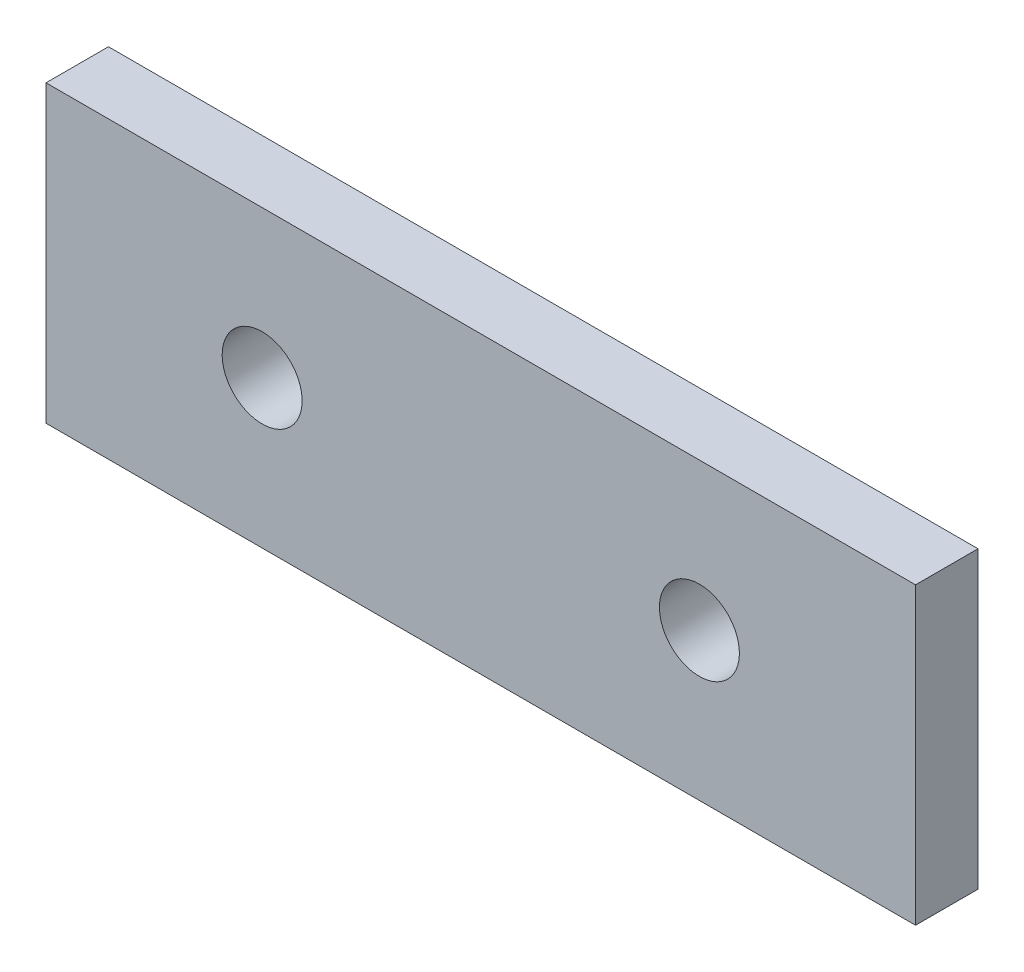
ISO-10303-21;
HEADER;
FILE_DESCRIPTION(('STEP AP214'),'2;1');
FILE_NAME('part.step','',(''),(''),'','','');
FILE_SCHEMA(('AUTOMOTIVE_DESIGN { 1 0 10303 214 1 1 1 1 }'));
ENDSEC;
DATA;
#1=APPLICATION_CONTEXT('core data for automotive mechanical design processes');
#2=APPLICATION_PROTOCOL_DEFINITION('international standard','automotive_design',2000,#1);
#3=PRODUCT_CONTEXT('',#1,'mechanical');
#4=PRODUCT('Part','Part','',(#3));
#5=PRODUCT_RELATED_PRODUCT_CATEGORY('part','',(#4));
#6=PRODUCT_DEFINITION_FORMATION('','',#4);
#7=PRODUCT_DEFINITION_CONTEXT('part definition',#1,'design');
#8=PRODUCT_DEFINITION('design','',#6,#7);
#9=PRODUCT_DEFINITION_SHAPE('','',#8);
#10=(LENGTH_UNIT() NAMED_UNIT(*) SI_UNIT(.MILLI.,.METRE.));
#11=(NAMED_UNIT(*) PLANE_ANGLE_UNIT() SI_UNIT($,.RADIAN.));
#12=(NAMED_UNIT(*) SI_UNIT($,.STERADIAN.) SOLID_ANGLE_UNIT());
#13=UNCERTAINTY_MEASURE_WITH_UNIT(LENGTH_MEASURE(1.E-05),#10,'distance_accuracy_value','');
#14=(GEOMETRIC_REPRESENTATION_CONTEXT(3) GLOBAL_UNCERTAINTY_ASSIGNED_CONTEXT((#13)) GLOBAL_UNIT_ASSIGNED_CONTEXT((#10,
#11,#12)) REPRESENTATION_CONTEXT('',''));
#15=CARTESIAN_POINT('',(0.,0.,0.));
#16=DIRECTION('',(0.,0.,1.));
#17=DIRECTION('',(1.,0.,0.));
#18=AXIS2_PLACEMENT_3D('',#15,#16,#17);
#19=CARTESIAN_POINT('',(-8.74999999999999,-24.,39.2461562615738));
#20=DIRECTION('',(0.,0.,-1.));
#21=DIRECTION('',(-1.,0.,0.));
#22=AXIS2_PLACEMENT_3D('',#19,#20,#21);
#23=CYLINDRICAL_SURFACE('',#22,1.6);
#24=CARTESIAN_POINT('',(-8.74999999999999,-24.,2.5));
#25=DIRECTION('',(0.,0.,-1.));
#26=DIRECTION('',(0.,1.,0.));
#27=AXIS2_PLACEMENT_3D('',#24,#25,#26);
#28=CIRCLE('',#27,1.6);
#29=CARTESIAN_POINT('',(-8.74999999999999,-22.4,2.49999999999999));
#30=VERTEX_POINT('',#29);
#31=EDGE_CURVE('E47',#30,#30,#28,.T.);
#32=ORIENTED_EDGE('',*,*,#31,.F.);
#33=EDGE_LOOP('',(#32));
#34=FACE_BOUND('',#33,.T.);
#35=CARTESIAN_POINT('',(-8.74999999999999,-24.,0.));
#36=DIRECTION('',(0.,0.,1.));
#37=DIRECTION('',(1.,0.,0.));
#38=AXIS2_PLACEMENT_3D('',#35,#36,#37);
#39=CIRCLE('',#38,1.6);
#40=CARTESIAN_POINT('',(-7.14999999999999,-24.,0.));
#41=VERTEX_POINT('',#40);
#42=EDGE_CURVE('E97',#41,#41,#39,.T.);
#43=ORIENTED_EDGE('',*,*,#42,.F.);
#44=EDGE_LOOP('',(#43));
#45=FACE_BOUND('',#44,.T.);
#46=ADVANCED_FACE('F37',(#34,#45),#23,.F.);
#47=CARTESIAN_POINT('',(8.75,-24.,39.2461562615738));
#48=DIRECTION('',(0.,0.,-1.));
#49=DIRECTION('',(-1.,0.,0.));
#50=AXIS2_PLACEMENT_3D('',#47,#48,#49);
#51=CYLINDRICAL_SURFACE('',#50,1.6);
#52=CARTESIAN_POINT('',(8.75,-24.,2.49999999999999));
#53=DIRECTION('',(0.,0.,-1.));
#54=DIRECTION('',(0.,1.,0.));
#55=AXIS2_PLACEMENT_3D('',#52,#53,#54);
#56=CIRCLE('',#55,1.6);
#57=CARTESIAN_POINT('',(8.75,-22.4,2.49999999999999));
#58=VERTEX_POINT('',#57);
#59=EDGE_CURVE('E11',#58,#58,#56,.T.);
#60=ORIENTED_EDGE('',*,*,#59,.F.);
#61=EDGE_LOOP('',(#60));
#62=FACE_BOUND('',#61,.T.);
#63=CARTESIAN_POINT('',(8.75,-24.,0.));
#64=DIRECTION('',(0.,0.,1.));
#65=DIRECTION('',(1.,0.,0.));
#66=AXIS2_PLACEMENT_3D('',#63,#64,#65);
#67=CIRCLE('',#66,1.6);
#68=CARTESIAN_POINT('',(10.35,-24.,0.));
#69=VERTEX_POINT('',#68);
#70=EDGE_CURVE('E100',#69,#69,#67,.T.);
#71=ORIENTED_EDGE('',*,*,#70,.F.);
#72=EDGE_LOOP('',(#71));
#73=FACE_BOUND('',#72,.T.);
#74=ADVANCED_FACE('F39',(#62,#73),#51,.F.);
#75=CARTESIAN_POINT('',(0.,0.,0.));
#76=DIRECTION('',(0.,0.,1.));
#77=DIRECTION('',(1.,0.,0.));
#78=AXIS2_PLACEMENT_3D('',#75,#76,#77);
#79=PLANE('',#78);
#80=ORIENTED_EDGE('',*,*,#70,.T.);
#81=EDGE_LOOP('',(#80));
#82=FACE_BOUND('',#81,.T.);
#83=ORIENTED_EDGE('',*,*,#42,.T.);
#84=EDGE_LOOP('',(#83));
#85=FACE_BOUND('',#84,.T.);
#86=DIRECTION('',(0.,-1.,0.));
#87=VECTOR('',#86,1.);
#88=CARTESIAN_POINT('',(-17.4,0.,0.));
#89=LINE('',#88,#87);
#90=CARTESIAN_POINT('',(-17.4,-18.1,0.));
#91=VERTEX_POINT('',#90);
#92=CARTESIAN_POINT('',(-17.4,-29.9,0.));
#93=VERTEX_POINT('',#92);
#94=EDGE_CURVE('E89',#91,#93,#89,.T.);
#95=ORIENTED_EDGE('',*,*,#94,.F.);
#96=DIRECTION('',(-1.,0.,0.));
#97=VECTOR('',#96,1.);
#98=CARTESIAN_POINT('',(0.,-18.1,0.));
#99=LINE('',#98,#97);
#100=CARTESIAN_POINT('',(17.4,-18.1,0.));
#101=VERTEX_POINT('',#100);
#102=EDGE_CURVE('E105',#101,#91,#99,.T.);
#103=ORIENTED_EDGE('',*,*,#102,.F.);
#104=DIRECTION('',(0.,1.,0.));
#105=VECTOR('',#104,1.);
#106=CARTESIAN_POINT('',(17.4,0.,0.));
#107=LINE('',#106,#105);
#108=CARTESIAN_POINT('',(17.4,-29.9,0.));
#109=VERTEX_POINT('',#108);
#110=EDGE_CURVE('E91',#109,#101,#107,.T.);
#111=ORIENTED_EDGE('',*,*,#110,.F.);
#112=DIRECTION('',(1.,0.,0.));
#113=VECTOR('',#112,1.);
#114=CARTESIAN_POINT('',(0.,-29.9,0.));
#115=LINE('',#114,#113);
#116=EDGE_CURVE('E79',#93,#109,#115,.T.);
#117=ORIENTED_EDGE('',*,*,#116,.F.);
#118=EDGE_LOOP('',(#95,#103,#111,#117));
#119=FACE_BOUND('',#118,.T.);
#120=ADVANCED_FACE('F87',(#82,#85,#119),#79,.F.);
#121=CARTESIAN_POINT('',(0.,-18.1,39.2461562615738));
#122=DIRECTION('',(0.,-1.,0.));
#123=DIRECTION('',(0.,0.,-1.));
#124=AXIS2_PLACEMENT_3D('',#121,#122,#123);
#125=PLANE('',#124);
#126=DIRECTION('',(0.,0.,-1.));
#127=VECTOR('',#126,1.);
#128=CARTESIAN_POINT('',(-17.4,-18.1,39.2461562615738));
#129=LINE('',#128,#127);
#130=CARTESIAN_POINT('',(-17.4,-18.1,2.49999999999999));
#131=VERTEX_POINT('',#130);
#132=EDGE_CURVE('E95',#131,#91,#129,.T.);
#133=ORIENTED_EDGE('',*,*,#132,.F.);
#134=DIRECTION('',(1.,0.,0.));
#135=VECTOR('',#134,1.);
#136=CARTESIAN_POINT('',(0.,-18.1,2.49999999999999));
#137=LINE('',#136,#135);
#138=CARTESIAN_POINT('',(17.4,-18.1,2.49999999999999));
#139=VERTEX_POINT('',#138);
#140=EDGE_CURVE('E41',#131,#139,#137,.T.);
#141=ORIENTED_EDGE('',*,*,#140,.T.);
#142=DIRECTION('',(0.,0.,-1.));
#143=VECTOR('',#142,1.);
#144=CARTESIAN_POINT('',(17.4,-18.1,39.2461562615738));
#145=LINE('',#144,#143);
#146=EDGE_CURVE('E108',#139,#101,#145,.T.);
#147=ORIENTED_EDGE('',*,*,#146,.T.);
#148=ORIENTED_EDGE('',*,*,#102,.T.);
#149=EDGE_LOOP('',(#133,#141,#147,#148));
#150=FACE_BOUND('',#149,.T.);
#151=ADVANCED_FACE('F133',(#150),#125,.F.);
#152=CARTESIAN_POINT('',(17.4,0.,39.2461562615738));
#153=DIRECTION('',(-1.,0.,0.));
#154=DIRECTION('',(0.,0.,1.));
#155=AXIS2_PLACEMENT_3D('',#152,#153,#154);
#156=PLANE('',#155);
#157=ORIENTED_EDGE('',*,*,#146,.F.);
#158=DIRECTION('',(0.,-1.,0.));
#159=VECTOR('',#158,1.);
#160=CARTESIAN_POINT('',(17.4,0.,2.49999999999998));
#161=LINE('',#160,#159);
#162=CARTESIAN_POINT('',(17.4,-29.9,2.49999999999999));
#163=VERTEX_POINT('',#162);
#164=EDGE_CURVE('E114',#139,#163,#161,.T.);
#165=ORIENTED_EDGE('',*,*,#164,.T.);
#166=DIRECTION('',(0.,0.,-1.));
#167=VECTOR('',#166,1.);
#168=CARTESIAN_POINT('',(17.4,-29.9,39.2461562615738));
#169=LINE('',#168,#167);
#170=EDGE_CURVE('E84',#163,#109,#169,.T.);
#171=ORIENTED_EDGE('',*,*,#170,.T.);
#172=ORIENTED_EDGE('',*,*,#110,.T.);
#173=EDGE_LOOP('',(#157,#165,#171,#172));
#174=FACE_BOUND('',#173,.T.);
#175=ADVANCED_FACE('F113',(#174),#156,.F.);
#176=CARTESIAN_POINT('',(0.,-29.9,39.2461562615738));
#177=DIRECTION('',(0.,1.,0.));
#178=DIRECTION('',(0.,0.,1.));
#179=AXIS2_PLACEMENT_3D('',#176,#177,#178);
#180=PLANE('',#179);
#181=ORIENTED_EDGE('',*,*,#170,.F.);
#182=DIRECTION('',(-1.,0.,0.));
#183=VECTOR('',#182,1.);
#184=CARTESIAN_POINT('',(0.,-29.9,2.5));
#185=LINE('',#184,#183);
#186=CARTESIAN_POINT('',(-17.4,-29.9,2.5));
#187=VERTEX_POINT('',#186);
#188=EDGE_CURVE('E55',#163,#187,#185,.T.);
#189=ORIENTED_EDGE('',*,*,#188,.T.);
#190=DIRECTION('',(0.,0.,-1.));
#191=VECTOR('',#190,1.);
#192=CARTESIAN_POINT('',(-17.4,-29.9,39.2461562615738));
#193=LINE('',#192,#191);
#194=EDGE_CURVE('E76',#187,#93,#193,.T.);
#195=ORIENTED_EDGE('',*,*,#194,.T.);
#196=ORIENTED_EDGE('',*,*,#116,.T.);
#197=EDGE_LOOP('',(#181,#189,#195,#196));
#198=FACE_BOUND('',#197,.T.);
#199=ADVANCED_FACE('F78',(#198),#180,.F.);
#200=CARTESIAN_POINT('',(-17.4,0.,39.2461562615738));
#201=DIRECTION('',(1.,0.,0.));
#202=DIRECTION('',(0.,0.,-1.));
#203=AXIS2_PLACEMENT_3D('',#200,#201,#202);
#204=PLANE('',#203);
#205=ORIENTED_EDGE('',*,*,#194,.F.);
#206=DIRECTION('',(0.,1.,0.));
#207=VECTOR('',#206,1.);
#208=CARTESIAN_POINT('',(-17.4,0.,2.49999999999999));
#209=LINE('',#208,#207);
#210=EDGE_CURVE('E117',#187,#131,#209,.T.);
#211=ORIENTED_EDGE('',*,*,#210,.T.);
#212=ORIENTED_EDGE('',*,*,#132,.T.);
#213=ORIENTED_EDGE('',*,*,#94,.T.);
#214=EDGE_LOOP('',(#205,#211,#212,#213));
#215=FACE_BOUND('',#214,.T.);
#216=ADVANCED_FACE('F93',(#215),#204,.F.);
#217=CARTESIAN_POINT('',(69.7615337539128,-100.,2.5));
#218=DIRECTION('',(0.,0.,-1.));
#219=DIRECTION('',(0.,-1.,0.));
#220=AXIS2_PLACEMENT_3D('',#217,#218,#219);
#221=PLANE('',#220);
#222=ORIENTED_EDGE('',*,*,#31,.T.);
#223=EDGE_LOOP('',(#222));
#224=FACE_BOUND('',#223,.T.);
#225=ORIENTED_EDGE('',*,*,#59,.T.);
#226=EDGE_LOOP('',(#225));
#227=FACE_BOUND('',#226,.T.);
#228=ORIENTED_EDGE('',*,*,#188,.F.);
#229=ORIENTED_EDGE('',*,*,#164,.F.);
#230=ORIENTED_EDGE('',*,*,#140,.F.);
#231=ORIENTED_EDGE('',*,*,#210,.F.);
#232=EDGE_LOOP('',(#228,#229,#230,#231));
#233=FACE_BOUND('',#232,.T.);
#234=ADVANCED_FACE('F138',(#224,#227,#233),#221,.F.);
#235=CLOSED_SHELL('',(#46,#74,#120,#151,#175,#199,#216,#234));
#236=MANIFOLD_SOLID_BREP('B2',#235);
#237=ADVANCED_BREP_SHAPE_REPRESENTATION('',(#18,#236),#14);
#238=SHAPE_DEFINITION_REPRESENTATION(#9,#237);
ENDSEC;
END-ISO-10303-21;
